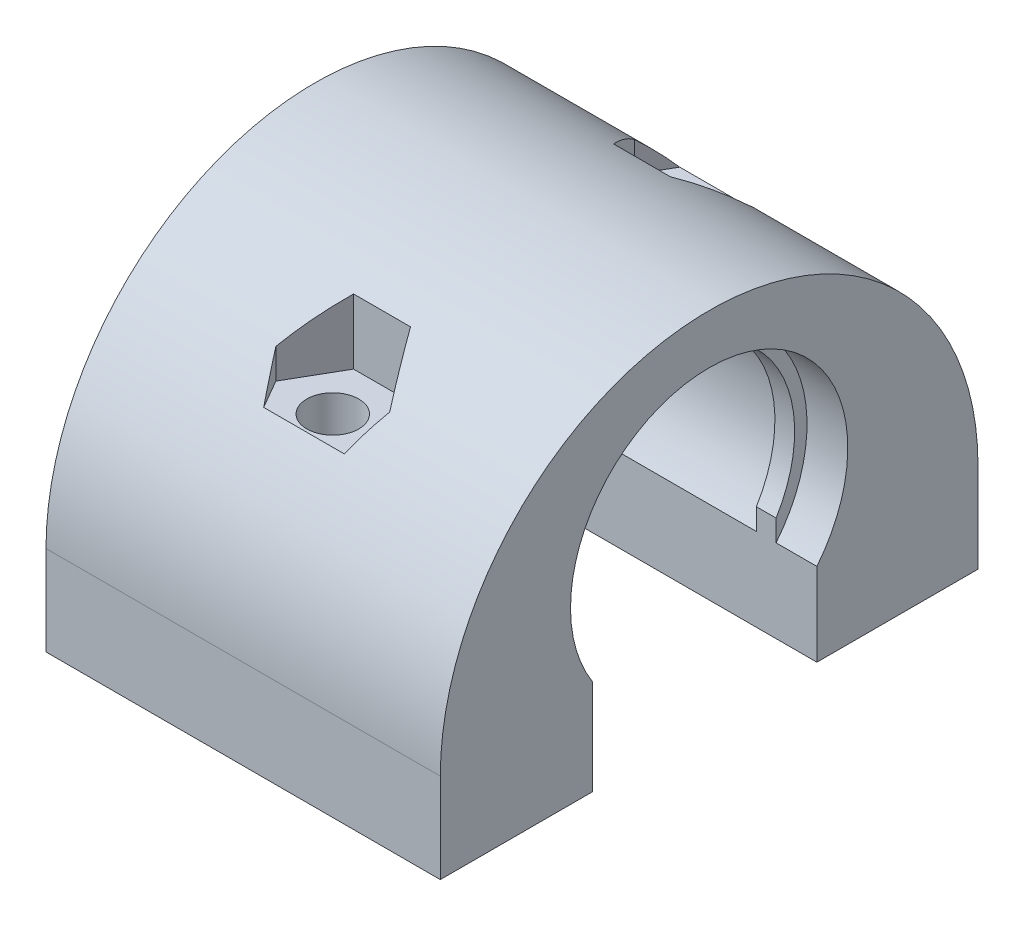
ISO-10303-21;
HEADER;
FILE_DESCRIPTION(('STEP AP214'),'2;1');
FILE_NAME('part.step','',(''),(''),'','','');
FILE_SCHEMA(('AUTOMOTIVE_DESIGN { 1 0 10303 214 1 1 1 1 }'));
ENDSEC;
DATA;
#1=APPLICATION_CONTEXT('core data for automotive mechanical design processes');
#2=APPLICATION_PROTOCOL_DEFINITION('international standard','automotive_design',2000,#1);
#3=PRODUCT_CONTEXT('',#1,'mechanical');
#4=PRODUCT('Part','Part','',(#3));
#5=PRODUCT_RELATED_PRODUCT_CATEGORY('part','',(#4));
#6=PRODUCT_DEFINITION_FORMATION('','',#4);
#7=PRODUCT_DEFINITION_CONTEXT('part definition',#1,'design');
#8=PRODUCT_DEFINITION('design','',#6,#7);
#9=PRODUCT_DEFINITION_SHAPE('','',#8);
#10=(LENGTH_UNIT() NAMED_UNIT(*) SI_UNIT(.MILLI.,.METRE.));
#11=(NAMED_UNIT(*) PLANE_ANGLE_UNIT() SI_UNIT($,.RADIAN.));
#12=(NAMED_UNIT(*) SI_UNIT($,.STERADIAN.) SOLID_ANGLE_UNIT());
#13=UNCERTAINTY_MEASURE_WITH_UNIT(LENGTH_MEASURE(1.E-05),#10,'distance_accuracy_value','');
#14=(GEOMETRIC_REPRESENTATION_CONTEXT(3) GLOBAL_UNCERTAINTY_ASSIGNED_CONTEXT((#13)) GLOBAL_UNIT_ASSIGNED_CONTEXT((#10,
#11,#12)) REPRESENTATION_CONTEXT('',''));
#15=CARTESIAN_POINT('',(0.,0.,0.));
#16=DIRECTION('',(0.,0.,1.));
#17=DIRECTION('',(1.,0.,0.));
#18=AXIS2_PLACEMENT_3D('',#15,#16,#17);
#19=CARTESIAN_POINT('',(3.00000000000002,9.5,0.));
#20=DIRECTION('',(-1.,0.,0.));
#21=DIRECTION('',(0.,0.,1.));
#22=AXIS2_PLACEMENT_3D('',#19,#20,#21);
#23=CYLINDRICAL_SURFACE('',#22,7.735);
#24=CARTESIAN_POINT('',(0.,9.5,0.));
#25=DIRECTION('',(-1.,0.,0.));
#26=DIRECTION('',(0.,0.,1.));
#27=AXIS2_PLACEMENT_3D('',#24,#25,#26);
#28=CIRCLE('',#27,7.735);
#29=CARTESIAN_POINT('',(0.,5.33016037673729,6.51480333673));
#30=VERTEX_POINT('',#29);
#31=CARTESIAN_POINT('',(0.,4.63069563489814,-6.01));
#32=VERTEX_POINT('',#31);
#33=EDGE_CURVE('E269',#30,#32,#28,.T.);
#34=ORIENTED_EDGE('',*,*,#33,.F.);
#35=DIRECTION('',(-1.,0.,0.));
#36=VECTOR('',#35,1.);
#37=CARTESIAN_POINT('',(3.00000000000002,5.33016037673729,6.51480333673));
#38=LINE('',#37,#36);
#39=CARTESIAN_POINT('',(-22.,5.33016037673729,6.51480333673));
#40=VERTEX_POINT('',#39);
#41=EDGE_CURVE('E50',#30,#40,#38,.T.);
#42=ORIENTED_EDGE('',*,*,#41,.T.);
#43=CARTESIAN_POINT('',(-22.,9.5,0.));
#44=DIRECTION('',(-1.,0.,0.));
#45=DIRECTION('',(0.,0.,1.));
#46=AXIS2_PLACEMENT_3D('',#43,#44,#45);
#47=CIRCLE('',#46,7.735);
#48=CARTESIAN_POINT('',(-22.,4.63069563489814,-6.01));
#49=VERTEX_POINT('',#48);
#50=EDGE_CURVE('E271',#40,#49,#47,.T.);
#51=ORIENTED_EDGE('',*,*,#50,.T.);
#52=DIRECTION('',(-1.,0.,0.));
#53=VECTOR('',#52,1.);
#54=CARTESIAN_POINT('',(3.00000000000002,4.63069563489814,-6.01));
#55=LINE('',#54,#53);
#56=CARTESIAN_POINT('',(-19.725,4.63069563489814,-6.01));
#57=VERTEX_POINT('',#56);
#58=EDGE_CURVE('E272',#49,#57,#55,.F.);
#59=ORIENTED_EDGE('',*,*,#58,.T.);
#60=CARTESIAN_POINT('',(-19.725,9.5,0.));
#61=DIRECTION('',(1.,0.,0.));
#62=DIRECTION('',(0.,0.,-1.));
#63=AXIS2_PLACEMENT_3D('',#60,#61,#62);
#64=CIRCLE('',#63,7.735);
#65=CARTESIAN_POINT('',(-19.725,17.2349983839688,-0.00500000000201291));
#66=VERTEX_POINT('',#65);
#67=EDGE_CURVE('E343',#66,#57,#64,.F.);
#68=ORIENTED_EDGE('',*,*,#67,.F.);
#69=DIRECTION('',(-1.,0.,0.));
#70=VECTOR('',#69,1.);
#71=CARTESIAN_POINT('',(-19.175,17.2349983839688,-0.00500000000201291));
#72=LINE('',#71,#70);
#73=CARTESIAN_POINT('',(-18.625,17.2349983839688,-0.00500000000201291));
#74=VERTEX_POINT('',#73);
#75=EDGE_CURVE('E335',#74,#66,#72,.T.);
#76=ORIENTED_EDGE('',*,*,#75,.F.);
#77=CARTESIAN_POINT('',(-18.625,9.5,0.));
#78=DIRECTION('',(-1.,0.,0.));
#79=DIRECTION('',(0.,0.,1.));
#80=AXIS2_PLACEMENT_3D('',#77,#78,#79);
#81=CIRCLE('',#80,7.735);
#82=CARTESIAN_POINT('',(-18.625,4.63069563489814,-6.01));
#83=VERTEX_POINT('',#82);
#84=EDGE_CURVE('E345',#83,#74,#81,.F.);
#85=ORIENTED_EDGE('',*,*,#84,.F.);
#86=CARTESIAN_POINT('',(-3.375,4.63069563489814,-6.01));
#87=VERTEX_POINT('',#86);
#88=EDGE_CURVE('E276',#83,#87,#55,.F.);
#89=ORIENTED_EDGE('',*,*,#88,.T.);
#90=CARTESIAN_POINT('',(-3.375,9.5,0.));
#91=DIRECTION('',(1.,0.,0.));
#92=DIRECTION('',(0.,0.,-1.));
#93=AXIS2_PLACEMENT_3D('',#90,#91,#92);
#94=CIRCLE('',#93,7.735);
#95=CARTESIAN_POINT('',(-3.375,17.2349983839688,-0.00500000000201291));
#96=VERTEX_POINT('',#95);
#97=EDGE_CURVE('E364',#96,#87,#94,.F.);
#98=ORIENTED_EDGE('',*,*,#97,.F.);
#99=DIRECTION('',(-1.,0.,0.));
#100=VECTOR('',#99,1.);
#101=CARTESIAN_POINT('',(-2.825,17.2349983839688,-0.00500000000201291));
#102=LINE('',#101,#100);
#103=CARTESIAN_POINT('',(-2.275,17.2349983839688,-0.00500000000201291));
#104=VERTEX_POINT('',#103);
#105=EDGE_CURVE('E358',#104,#96,#102,.T.);
#106=ORIENTED_EDGE('',*,*,#105,.F.);
#107=CARTESIAN_POINT('',(-2.275,9.5,0.));
#108=DIRECTION('',(-1.,0.,0.));
#109=DIRECTION('',(0.,0.,1.));
#110=AXIS2_PLACEMENT_3D('',#107,#108,#109);
#111=CIRCLE('',#110,7.735);
#112=CARTESIAN_POINT('',(-2.275,4.63069563489814,-6.01));
#113=VERTEX_POINT('',#112);
#114=EDGE_CURVE('E361',#113,#104,#111,.F.);
#115=ORIENTED_EDGE('',*,*,#114,.F.);
#116=EDGE_CURVE('E268',#113,#32,#55,.F.);
#117=ORIENTED_EDGE('',*,*,#116,.T.);
#118=EDGE_LOOP('',(#34,#42,#51,#59,#68,#76,#85,#89,#98,#106,#115,#117));
#119=FACE_BOUND('',#118,.T.);
#120=ADVANCED_FACE('F34',(#119),#23,.F.);
#121=CARTESIAN_POINT('',(-22.,4.99999999999999,-6.01));
#122=DIRECTION('',(0.,0.,-1.));
#123=DIRECTION('',(-1.,0.,0.));
#124=AXIS2_PLACEMENT_3D('',#121,#122,#123);
#125=PLANE('',#124);
#126=ORIENTED_EDGE('',*,*,#116,.F.);
#127=DIRECTION('',(0.,-1.,0.));
#128=VECTOR('',#127,1.);
#129=CARTESIAN_POINT('',(-2.275,17.235,-6.01));
#130=LINE('',#129,#128);
#131=CARTESIAN_POINT('',(-2.275,5.82695970618343,-6.01));
#132=VERTEX_POINT('',#131);
#133=EDGE_CURVE('E481',#132,#113,#130,.T.);
#134=ORIENTED_EDGE('',*,*,#133,.F.);
#135=DIRECTION('',(-1.,0.,0.));
#136=VECTOR('',#135,1.);
#137=CARTESIAN_POINT('',(-21.5348154568122,5.82695970618343,-6.01));
#138=LINE('',#137,#136);
#139=CARTESIAN_POINT('',(-3.375,5.82695970618343,-6.01));
#140=VERTEX_POINT('',#139);
#141=EDGE_CURVE('E484',#140,#132,#138,.F.);
#142=ORIENTED_EDGE('',*,*,#141,.F.);
#143=DIRECTION('',(0.,1.,0.));
#144=VECTOR('',#143,1.);
#145=CARTESIAN_POINT('',(-3.375,17.235,-6.01));
#146=LINE('',#145,#144);
#147=EDGE_CURVE('E471',#87,#140,#146,.T.);
#148=ORIENTED_EDGE('',*,*,#147,.F.);
#149=ORIENTED_EDGE('',*,*,#88,.F.);
#150=DIRECTION('',(0.,-1.,0.));
#151=VECTOR('',#150,1.);
#152=CARTESIAN_POINT('',(-18.625,17.235,-6.01));
#153=LINE('',#152,#151);
#154=CARTESIAN_POINT('',(-18.625,5.82695970618343,-6.01));
#155=VERTEX_POINT('',#154);
#156=EDGE_CURVE('E489',#155,#83,#153,.T.);
#157=ORIENTED_EDGE('',*,*,#156,.F.);
#158=DIRECTION('',(-1.,0.,0.));
#159=VECTOR('',#158,1.);
#160=CARTESIAN_POINT('',(-21.5348154568122,5.82695970618344,-6.01));
#161=LINE('',#160,#159);
#162=CARTESIAN_POINT('',(-19.725,5.82695970618344,-6.01));
#163=VERTEX_POINT('',#162);
#164=EDGE_CURVE('E11',#163,#155,#161,.F.);
#165=ORIENTED_EDGE('',*,*,#164,.F.);
#166=DIRECTION('',(0.,1.,0.));
#167=VECTOR('',#166,1.);
#168=CARTESIAN_POINT('',(-19.725,17.235,-6.01));
#169=LINE('',#168,#167);
#170=EDGE_CURVE('E332',#57,#163,#169,.T.);
#171=ORIENTED_EDGE('',*,*,#170,.F.);
#172=ORIENTED_EDGE('',*,*,#58,.F.);
#173=DIRECTION('',(0.,-1.,0.));
#174=VECTOR('',#173,1.);
#175=CARTESIAN_POINT('',(-22.,4.99999999999999,-6.01));
#176=LINE('',#175,#174);
#177=CARTESIAN_POINT('',(-22.,0.,-6.01));
#178=VERTEX_POINT('',#177);
#179=EDGE_CURVE('E419',#49,#178,#176,.T.);
#180=ORIENTED_EDGE('',*,*,#179,.T.);
#181=DIRECTION('',(1.,0.,0.));
#182=VECTOR('',#181,1.);
#183=CARTESIAN_POINT('',(-22.,0.,-6.01));
#184=LINE('',#183,#182);
#185=CARTESIAN_POINT('',(0.,0.,-6.01));
#186=VERTEX_POINT('',#185);
#187=EDGE_CURVE('E417',#178,#186,#184,.T.);
#188=ORIENTED_EDGE('',*,*,#187,.T.);
#189=DIRECTION('',(0.,-1.,0.));
#190=VECTOR('',#189,1.);
#191=CARTESIAN_POINT('',(0.,4.99999999999999,-6.01));
#192=LINE('',#191,#190);
#193=EDGE_CURVE('E420',#32,#186,#192,.T.);
#194=ORIENTED_EDGE('',*,*,#193,.F.);
#195=EDGE_LOOP('',(#126,#134,#142,#148,#149,#157,#165,#171,#172,#180,#188,#194));
#196=FACE_BOUND('',#195,.T.);
#197=ADVANCED_FACE('F456',(#196),#125,.F.);
#198=CARTESIAN_POINT('',(-22.,5.,0.));
#199=DIRECTION('',(-1.,0.,0.));
#200=DIRECTION('',(0.,0.,1.));
#201=AXIS2_PLACEMENT_3D('',#198,#199,#200);
#202=CYLINDRICAL_SURFACE('',#201,15.);
#203=CARTESIAN_POINT('',(-2.05149730810374,5.,0.));
#204=DIRECTION('',(-0.866025403784439,0.,0.5));
#205=DIRECTION('',(-0.5,0.,-0.866025403784439));
#206=AXIS2_PLACEMENT_3D('',#203,#204,#205);
#207=ELLIPSE('',#206,17.3205080756888,15.);
#208=CARTESIAN_POINT('',(-8.75348706239811,14.5,-11.6081867662439));
#209=VERTEX_POINT('',#208);
#210=CARTESIAN_POINT('',(-7.825,16.1803398874989,-10.));
#211=VERTEX_POINT('',#210);
#212=EDGE_CURVE('E275',#209,#211,#207,.F.);
#213=ORIENTED_EDGE('',*,*,#212,.T.);
#214=CARTESIAN_POINT('',(-13.5985026918963,5.,0.));
#215=DIRECTION('',(-0.866025403784439,0.,-0.5));
#216=DIRECTION('',(-0.5,0.,0.866025403784439));
#217=AXIS2_PLACEMENT_3D('',#214,#215,#216);
#218=ELLIPSE('',#217,17.3205080756888,15.);
#219=CARTESIAN_POINT('',(-9.4125,18.1313420635635,-7.25036934298441));
#220=VERTEX_POINT('',#219);
#221=EDGE_CURVE('E297',#211,#220,#218,.F.);
#222=ORIENTED_EDGE('',*,*,#221,.T.);
#223=DIRECTION('',(-1.,0.,0.));
#224=VECTOR('',#223,1.);
#225=CARTESIAN_POINT('',(-22.,18.1313420635635,-7.25036934298441));
#226=LINE('',#225,#224);
#227=CARTESIAN_POINT('',(-12.5875,18.1313420635635,-7.25036934298441));
#228=VERTEX_POINT('',#227);
#229=EDGE_CURVE('E294',#220,#228,#226,.T.);
#230=ORIENTED_EDGE('',*,*,#229,.T.);
#231=CARTESIAN_POINT('',(-8.40149730810373,5.,0.));
#232=DIRECTION('',(0.866025403784438,0.,-0.5));
#233=DIRECTION('',(-0.5,0.,-0.866025403784438));
#234=AXIS2_PLACEMENT_3D('',#231,#232,#233);
#235=ELLIPSE('',#234,17.3205080756888,15.);
#236=CARTESIAN_POINT('',(-14.175,16.1803398874989,-10.));
#237=VERTEX_POINT('',#236);
#238=EDGE_CURVE('E291',#228,#237,#235,.F.);
#239=ORIENTED_EDGE('',*,*,#238,.T.);
#240=CARTESIAN_POINT('',(-19.9485026918963,5.,0.));
#241=DIRECTION('',(0.866025403784438,0.,0.500000000000001));
#242=DIRECTION('',(-0.500000000000001,0.,0.866025403784438));
#243=AXIS2_PLACEMENT_3D('',#240,#241,#242);
#244=ELLIPSE('',#243,17.3205080756888,15.);
#245=CARTESIAN_POINT('',(-13.2465129376019,14.5,-11.6081867662439));
#246=VERTEX_POINT('',#245);
#247=EDGE_CURVE('E288',#237,#246,#244,.F.);
#248=ORIENTED_EDGE('',*,*,#247,.T.);
#249=DIRECTION('',(-1.,0.,0.));
#250=VECTOR('',#249,1.);
#251=CARTESIAN_POINT('',(-22.,14.5,-11.6081867662439));
#252=LINE('',#251,#250);
#253=EDGE_CURVE('E280',#246,#209,#252,.F.);
#254=ORIENTED_EDGE('',*,*,#253,.T.);
#255=EDGE_LOOP('',(#213,#222,#230,#239,#248,#254));
#256=FACE_BOUND('',#255,.T.);
#257=DIRECTION('',(1.,0.,0.));
#258=VECTOR('',#257,1.);
#259=CARTESIAN_POINT('',(-22.,5.,-15.));
#260=LINE('',#259,#258);
#261=CARTESIAN_POINT('',(-22.,5.,-15.));
#262=VERTEX_POINT('',#261);
#263=CARTESIAN_POINT('',(0.,5.,-15.));
#264=VERTEX_POINT('',#263);
#265=EDGE_CURVE('E258',#262,#264,#260,.T.);
#266=ORIENTED_EDGE('',*,*,#265,.F.);
#267=CARTESIAN_POINT('',(-22.,5.,0.));
#268=DIRECTION('',(1.,0.,0.));
#269=DIRECTION('',(0.,0.,-1.));
#270=AXIS2_PLACEMENT_3D('',#267,#268,#269);
#271=CIRCLE('',#270,15.);
#272=CARTESIAN_POINT('',(-22.,5.,15.));
#273=VERTEX_POINT('',#272);
#274=EDGE_CURVE('E264',#273,#262,#271,.F.);
#275=ORIENTED_EDGE('',*,*,#274,.F.);
#276=DIRECTION('',(1.,0.,0.));
#277=VECTOR('',#276,1.);
#278=CARTESIAN_POINT('',(-22.,5.,15.));
#279=LINE('',#278,#277);
#280=CARTESIAN_POINT('',(0.,5.,15.));
#281=VERTEX_POINT('',#280);
#282=EDGE_CURVE('E261',#281,#273,#279,.F.);
#283=ORIENTED_EDGE('',*,*,#282,.F.);
#284=CARTESIAN_POINT('',(0.,5.,0.));
#285=DIRECTION('',(-1.,0.,0.));
#286=DIRECTION('',(0.,0.,1.));
#287=AXIS2_PLACEMENT_3D('',#284,#285,#286);
#288=CIRCLE('',#287,15.);
#289=EDGE_CURVE('E266',#264,#281,#288,.F.);
#290=ORIENTED_EDGE('',*,*,#289,.F.);
#291=EDGE_LOOP('',(#266,#275,#283,#290));
#292=FACE_BOUND('',#291,.T.);
#293=DIRECTION('',(-1.,0.,0.));
#294=VECTOR('',#293,1.);
#295=CARTESIAN_POINT('',(-22.,14.5,11.6081867662439));
#296=LINE('',#295,#294);
#297=CARTESIAN_POINT('',(-8.75348706239811,14.5,11.6081867662439));
#298=VERTEX_POINT('',#297);
#299=CARTESIAN_POINT('',(-13.2465129376019,14.5,11.6081867662439));
#300=VERTEX_POINT('',#299);
#301=EDGE_CURVE('E285',#298,#300,#296,.T.);
#302=ORIENTED_EDGE('',*,*,#301,.T.);
#303=CARTESIAN_POINT('',(-19.9485026918963,5.,0.));
#304=DIRECTION('',(0.866025403784439,0.,-0.5));
#305=DIRECTION('',(-0.5,0.,-0.866025403784439));
#306=AXIS2_PLACEMENT_3D('',#303,#304,#305);
#307=ELLIPSE('',#306,17.3205080756888,15.);
#308=CARTESIAN_POINT('',(-14.175,16.180339887499,10.));
#309=VERTEX_POINT('',#308);
#310=EDGE_CURVE('E312',#300,#309,#307,.F.);
#311=ORIENTED_EDGE('',*,*,#310,.T.);
#312=CARTESIAN_POINT('',(-8.40149730810373,5.,0.));
#313=DIRECTION('',(0.866025403784439,0.,0.5));
#314=DIRECTION('',(-0.5,0.,0.866025403784439));
#315=AXIS2_PLACEMENT_3D('',#312,#313,#314);
#316=ELLIPSE('',#315,17.3205080756888,15.);
#317=CARTESIAN_POINT('',(-12.5875,18.1313420635635,7.25036934298441));
#318=VERTEX_POINT('',#317);
#319=EDGE_CURVE('E309',#309,#318,#316,.F.);
#320=ORIENTED_EDGE('',*,*,#319,.T.);
#321=DIRECTION('',(-1.,0.,0.));
#322=VECTOR('',#321,1.);
#323=CARTESIAN_POINT('',(-22.,18.1313420635635,7.25036934298441));
#324=LINE('',#323,#322);
#325=CARTESIAN_POINT('',(-9.41249999999999,18.1313420635635,7.25036934298441));
#326=VERTEX_POINT('',#325);
#327=EDGE_CURVE('E306',#318,#326,#324,.F.);
#328=ORIENTED_EDGE('',*,*,#327,.T.);
#329=CARTESIAN_POINT('',(-13.5985026918962,5.,0.));
#330=DIRECTION('',(-0.866025403784439,0.,0.499999999999999));
#331=DIRECTION('',(-0.499999999999999,0.,-0.866025403784439));
#332=AXIS2_PLACEMENT_3D('',#329,#330,#331);
#333=ELLIPSE('',#332,17.3205080756888,15.);
#334=CARTESIAN_POINT('',(-7.82499999999999,16.180339887499,10.));
#335=VERTEX_POINT('',#334);
#336=EDGE_CURVE('E303',#326,#335,#333,.F.);
#337=ORIENTED_EDGE('',*,*,#336,.T.);
#338=CARTESIAN_POINT('',(-2.05149730810374,5.,0.));
#339=DIRECTION('',(-0.866025403784439,0.,-0.5));
#340=DIRECTION('',(-0.5,0.,0.866025403784439));
#341=AXIS2_PLACEMENT_3D('',#338,#339,#340);
#342=ELLIPSE('',#341,17.3205080756888,15.);
#343=EDGE_CURVE('E300',#335,#298,#342,.F.);
#344=ORIENTED_EDGE('',*,*,#343,.T.);
#345=EDGE_LOOP('',(#302,#311,#320,#328,#337,#344));
#346=FACE_BOUND('',#345,.T.);
#347=ADVANCED_FACE('F37',(#256,#292,#346),#202,.T.);
#348=CARTESIAN_POINT('',(-11.,19.,10.));
#349=DIRECTION('',(0.,-1.,0.));
#350=DIRECTION('',(0.,0.,-1.));
#351=AXIS2_PLACEMENT_3D('',#348,#349,#350);
#352=CYLINDRICAL_SURFACE('',#351,1.45);
#353=CARTESIAN_POINT('',(-11.,0.,10.));
#354=DIRECTION('',(0.,-1.,0.));
#355=DIRECTION('',(0.,0.,-1.));
#356=AXIS2_PLACEMENT_3D('',#353,#354,#355);
#357=CIRCLE('',#356,1.45);
#358=CARTESIAN_POINT('',(-11.,0.,8.55));
#359=VERTEX_POINT('',#358);
#360=EDGE_CURVE('E423',#359,#359,#357,.T.);
#361=ORIENTED_EDGE('',*,*,#360,.T.);
#362=EDGE_LOOP('',(#361));
#363=FACE_BOUND('',#362,.T.);
#364=CARTESIAN_POINT('',(-11.,14.5,10.));
#365=DIRECTION('',(0.,1.,0.));
#366=DIRECTION('',(0.,0.,1.));
#367=AXIS2_PLACEMENT_3D('',#364,#365,#366);
#368=CIRCLE('',#367,1.45);
#369=CARTESIAN_POINT('',(-11.,14.5,11.45));
#370=VERTEX_POINT('',#369);
#371=EDGE_CURVE('E282',#370,#370,#368,.F.);
#372=ORIENTED_EDGE('',*,*,#371,.F.);
#373=EDGE_LOOP('',(#372));
#374=FACE_BOUND('',#373,.T.);
#375=ADVANCED_FACE('F528',(#363,#374),#352,.F.);
#376=CARTESIAN_POINT('',(-11.,19.,-10.));
#377=DIRECTION('',(0.,-1.,0.));
#378=DIRECTION('',(0.,0.,-1.));
#379=AXIS2_PLACEMENT_3D('',#376,#377,#378);
#380=CYLINDRICAL_SURFACE('',#379,1.45);
#381=CARTESIAN_POINT('',(-11.,0.,-10.));
#382=DIRECTION('',(0.,-1.,0.));
#383=DIRECTION('',(0.,0.,-1.));
#384=AXIS2_PLACEMENT_3D('',#381,#382,#383);
#385=CIRCLE('',#384,1.45);
#386=CARTESIAN_POINT('',(-11.,0.,-11.45));
#387=VERTEX_POINT('',#386);
#388=EDGE_CURVE('E425',#387,#387,#385,.T.);
#389=ORIENTED_EDGE('',*,*,#388,.T.);
#390=EDGE_LOOP('',(#389));
#391=FACE_BOUND('',#390,.T.);
#392=CARTESIAN_POINT('',(-11.,14.5,-10.));
#393=DIRECTION('',(0.,1.,0.));
#394=DIRECTION('',(0.,0.,1.));
#395=AXIS2_PLACEMENT_3D('',#392,#393,#394);
#396=CIRCLE('',#395,1.45);
#397=CARTESIAN_POINT('',(-11.,14.5,-8.55));
#398=VERTEX_POINT('',#397);
#399=EDGE_CURVE('E277',#398,#398,#396,.F.);
#400=ORIENTED_EDGE('',*,*,#399,.F.);
#401=EDGE_LOOP('',(#400));
#402=FACE_BOUND('',#401,.T.);
#403=ADVANCED_FACE('F543',(#391,#402),#380,.F.);
#404=CARTESIAN_POINT('',(0.,0.,0.));
#405=DIRECTION('',(0.,1.,0.));
#406=DIRECTION('',(0.,0.,1.));
#407=AXIS2_PLACEMENT_3D('',#404,#405,#406);
#408=PLANE('',#407);
#409=ORIENTED_EDGE('',*,*,#360,.F.);
#410=EDGE_LOOP('',(#409));
#411=FACE_BOUND('',#410,.T.);
#412=DIRECTION('',(0.,0.,1.));
#413=VECTOR('',#412,1.);
#414=CARTESIAN_POINT('',(-22.,0.,-15.));
#415=LINE('',#414,#413);
#416=CARTESIAN_POINT('',(-22.,0.,6.51480333673));
#417=VERTEX_POINT('',#416);
#418=CARTESIAN_POINT('',(-22.,0.,15.));
#419=VERTEX_POINT('',#418);
#420=EDGE_CURVE('E233',#417,#419,#415,.T.);
#421=ORIENTED_EDGE('',*,*,#420,.F.);
#422=DIRECTION('',(-1.,0.,0.));
#423=VECTOR('',#422,1.);
#424=CARTESIAN_POINT('',(0.,0.,6.51480333673));
#425=LINE('',#424,#423);
#426=CARTESIAN_POINT('',(0.,0.,6.51480333673));
#427=VERTEX_POINT('',#426);
#428=EDGE_CURVE('E220',#427,#417,#425,.T.);
#429=ORIENTED_EDGE('',*,*,#428,.F.);
#430=DIRECTION('',(0.,0.,-1.));
#431=VECTOR('',#430,1.);
#432=CARTESIAN_POINT('',(0.,0.,-15.));
#433=LINE('',#432,#431);
#434=CARTESIAN_POINT('',(0.,0.,15.));
#435=VERTEX_POINT('',#434);
#436=EDGE_CURVE('E232',#435,#427,#433,.T.);
#437=ORIENTED_EDGE('',*,*,#436,.F.);
#438=DIRECTION('',(1.,0.,0.));
#439=VECTOR('',#438,1.);
#440=CARTESIAN_POINT('',(-22.,0.,15.));
#441=LINE('',#440,#439);
#442=EDGE_CURVE('E246',#419,#435,#441,.T.);
#443=ORIENTED_EDGE('',*,*,#442,.F.);
#444=EDGE_LOOP('',(#421,#429,#437,#443));
#445=FACE_BOUND('',#444,.T.);
#446=ADVANCED_FACE('F230',(#411,#445),#408,.F.);
#447=CARTESIAN_POINT('',(-22.,20.,-15.));
#448=DIRECTION('',(1.,0.,0.));
#449=DIRECTION('',(0.,0.,-1.));
#450=AXIS2_PLACEMENT_3D('',#447,#448,#449);
#451=PLANE('',#450);
#452=ORIENTED_EDGE('',*,*,#50,.F.);
#453=DIRECTION('',(0.,1.,0.));
#454=VECTOR('',#453,1.);
#455=CARTESIAN_POINT('',(-22.,0.,6.51480333673));
#456=LINE('',#455,#454);
#457=EDGE_CURVE('E225',#417,#40,#456,.T.);
#458=ORIENTED_EDGE('',*,*,#457,.F.);
#459=ORIENTED_EDGE('',*,*,#420,.T.);
#460=DIRECTION('',(0.,-1.,0.));
#461=VECTOR('',#460,1.);
#462=CARTESIAN_POINT('',(-22.,20.,15.));
#463=LINE('',#462,#461);
#464=EDGE_CURVE('E255',#273,#419,#463,.T.);
#465=ORIENTED_EDGE('',*,*,#464,.F.);
#466=ORIENTED_EDGE('',*,*,#274,.T.);
#467=DIRECTION('',(0.,-1.,0.));
#468=VECTOR('',#467,1.);
#469=CARTESIAN_POINT('',(-22.,20.,-15.));
#470=LINE('',#469,#468);
#471=CARTESIAN_POINT('',(-22.,0.,-15.));
#472=VERTEX_POINT('',#471);
#473=EDGE_CURVE('E244',#262,#472,#470,.T.);
#474=ORIENTED_EDGE('',*,*,#473,.T.);
#475=EDGE_CURVE('E430',#472,#178,#415,.T.);
#476=ORIENTED_EDGE('',*,*,#475,.T.);
#477=ORIENTED_EDGE('',*,*,#179,.F.);
#478=EDGE_LOOP('',(#452,#458,#459,#465,#466,#474,#476,#477));
#479=FACE_BOUND('',#478,.T.);
#480=ADVANCED_FACE('F437',(#479),#451,.F.);
#481=CARTESIAN_POINT('',(-22.,20.,15.));
#482=DIRECTION('',(0.,0.,-1.));
#483=DIRECTION('',(-1.,0.,0.));
#484=AXIS2_PLACEMENT_3D('',#481,#482,#483);
#485=PLANE('',#484);
#486=ORIENTED_EDGE('',*,*,#464,.T.);
#487=ORIENTED_EDGE('',*,*,#442,.T.);
#488=DIRECTION('',(0.,-1.,0.));
#489=VECTOR('',#488,1.);
#490=CARTESIAN_POINT('',(0.,20.,15.));
#491=LINE('',#490,#489);
#492=EDGE_CURVE('E238',#281,#435,#491,.T.);
#493=ORIENTED_EDGE('',*,*,#492,.F.);
#494=ORIENTED_EDGE('',*,*,#282,.T.);
#495=EDGE_LOOP('',(#486,#487,#493,#494));
#496=FACE_BOUND('',#495,.T.);
#497=ADVANCED_FACE('F439',(#496),#485,.F.);
#498=CARTESIAN_POINT('',(0.,20.,-15.));
#499=DIRECTION('',(-1.,0.,0.));
#500=DIRECTION('',(0.,0.,1.));
#501=AXIS2_PLACEMENT_3D('',#498,#499,#500);
#502=PLANE('',#501);
#503=ORIENTED_EDGE('',*,*,#436,.T.);
#504=DIRECTION('',(0.,1.,0.));
#505=VECTOR('',#504,1.);
#506=CARTESIAN_POINT('',(0.,0.,6.51480333673));
#507=LINE('',#506,#505);
#508=EDGE_CURVE('E217',#427,#30,#507,.T.);
#509=ORIENTED_EDGE('',*,*,#508,.T.);
#510=ORIENTED_EDGE('',*,*,#33,.T.);
#511=ORIENTED_EDGE('',*,*,#193,.T.);
#512=CARTESIAN_POINT('',(0.,0.,-15.));
#513=VERTEX_POINT('',#512);
#514=EDGE_CURVE('E241',#186,#513,#433,.T.);
#515=ORIENTED_EDGE('',*,*,#514,.T.);
#516=DIRECTION('',(0.,-1.,0.));
#517=VECTOR('',#516,1.);
#518=CARTESIAN_POINT('',(0.,20.,-15.));
#519=LINE('',#518,#517);
#520=EDGE_CURVE('E251',#264,#513,#519,.T.);
#521=ORIENTED_EDGE('',*,*,#520,.F.);
#522=ORIENTED_EDGE('',*,*,#289,.T.);
#523=ORIENTED_EDGE('',*,*,#492,.T.);
#524=EDGE_LOOP('',(#503,#509,#510,#511,#515,#521,#522,#523));
#525=FACE_BOUND('',#524,.T.);
#526=ADVANCED_FACE('F236',(#525),#502,.F.);
#527=CARTESIAN_POINT('',(-22.,20.,-15.));
#528=DIRECTION('',(0.,0.,1.));
#529=DIRECTION('',(1.,0.,0.));
#530=AXIS2_PLACEMENT_3D('',#527,#528,#529);
#531=PLANE('',#530);
#532=ORIENTED_EDGE('',*,*,#473,.F.);
#533=ORIENTED_EDGE('',*,*,#265,.T.);
#534=ORIENTED_EDGE('',*,*,#520,.T.);
#535=DIRECTION('',(-1.,0.,0.));
#536=VECTOR('',#535,1.);
#537=CARTESIAN_POINT('',(-22.,0.,-15.));
#538=LINE('',#537,#536);
#539=EDGE_CURVE('E240',#513,#472,#538,.T.);
#540=ORIENTED_EDGE('',*,*,#539,.T.);
#541=EDGE_LOOP('',(#532,#533,#534,#540));
#542=FACE_BOUND('',#541,.T.);
#543=ADVANCED_FACE('F447',(#542),#531,.F.);
#544=ORIENTED_EDGE('',*,*,#388,.F.);
#545=EDGE_LOOP('',(#544));
#546=FACE_BOUND('',#545,.T.);
#547=ORIENTED_EDGE('',*,*,#514,.F.);
#548=ORIENTED_EDGE('',*,*,#187,.F.);
#549=ORIENTED_EDGE('',*,*,#475,.F.);
#550=ORIENTED_EDGE('',*,*,#539,.F.);
#551=EDGE_LOOP('',(#547,#548,#549,#550));
#552=FACE_BOUND('',#551,.T.);
#553=ADVANCED_FACE('F452',(#546,#552),#408,.F.);
#554=CARTESIAN_POINT('',(0.,14.5,0.));
#555=DIRECTION('',(0.,1.,0.));
#556=DIRECTION('',(0.,0.,1.));
#557=AXIS2_PLACEMENT_3D('',#554,#555,#556);
#558=PLANE('',#557);
#559=DIRECTION('',(0.500000000000001,0.,-0.866025403784438));
#560=VECTOR('',#559,1.);
#561=CARTESIAN_POINT('',(-12.5875,14.5,-12.7496306570156));
#562=LINE('',#561,#560);
#563=CARTESIAN_POINT('',(-14.175,14.5,-10.));
#564=VERTEX_POINT('',#563);
#565=EDGE_CURVE('E397',#564,#246,#562,.T.);
#566=ORIENTED_EDGE('',*,*,#565,.F.);
#567=DIRECTION('',(-0.5,0.,-0.866025403784438));
#568=VECTOR('',#567,1.);
#569=CARTESIAN_POINT('',(-14.175,14.5,-10.));
#570=LINE('',#569,#568);
#571=CARTESIAN_POINT('',(-12.5875,14.5,-7.25036934298441));
#572=VERTEX_POINT('',#571);
#573=EDGE_CURVE('E395',#572,#564,#570,.T.);
#574=ORIENTED_EDGE('',*,*,#573,.F.);
#575=DIRECTION('',(-1.,0.,0.));
#576=VECTOR('',#575,1.);
#577=CARTESIAN_POINT('',(-12.5875,14.5,-7.25036934298441));
#578=LINE('',#577,#576);
#579=CARTESIAN_POINT('',(-9.4125,14.5,-7.25036934298441));
#580=VERTEX_POINT('',#579);
#581=EDGE_CURVE('E393',#580,#572,#578,.T.);
#582=ORIENTED_EDGE('',*,*,#581,.F.);
#583=DIRECTION('',(-0.5,0.,0.866025403784439));
#584=VECTOR('',#583,1.);
#585=CARTESIAN_POINT('',(-9.4125,14.5,-7.25036934298441));
#586=LINE('',#585,#584);
#587=CARTESIAN_POINT('',(-7.825,14.5,-10.));
#588=VERTEX_POINT('',#587);
#589=EDGE_CURVE('E367',#588,#580,#586,.T.);
#590=ORIENTED_EDGE('',*,*,#589,.F.);
#591=DIRECTION('',(0.5,0.,0.866025403784439));
#592=VECTOR('',#591,1.);
#593=CARTESIAN_POINT('',(-7.825,14.5,-10.));
#594=LINE('',#593,#592);
#595=EDGE_CURVE('E400',#209,#588,#594,.T.);
#596=ORIENTED_EDGE('',*,*,#595,.F.);
#597=ORIENTED_EDGE('',*,*,#253,.F.);
#598=EDGE_LOOP('',(#566,#574,#582,#590,#596,#597));
#599=FACE_BOUND('',#598,.T.);
#600=ORIENTED_EDGE('',*,*,#399,.T.);
#601=EDGE_LOOP('',(#600));
#602=FACE_BOUND('',#601,.T.);
#603=ADVANCED_FACE('F532',(#599,#602),#558,.T.);
#604=CARTESIAN_POINT('',(-9.4125,14.5,-7.25036934298441));
#605=DIRECTION('',(-0.866025403784439,0.,-0.5));
#606=DIRECTION('',(-0.5,0.,0.866025403784439));
#607=AXIS2_PLACEMENT_3D('',#604,#605,#606);
#608=PLANE('',#607);
#609=DIRECTION('',(0.,1.,0.));
#610=VECTOR('',#609,1.);
#611=CARTESIAN_POINT('',(-7.825,14.5,-10.));
#612=LINE('',#611,#610);
#613=EDGE_CURVE('E402',#588,#211,#612,.T.);
#614=ORIENTED_EDGE('',*,*,#613,.F.);
#615=ORIENTED_EDGE('',*,*,#589,.T.);
#616=DIRECTION('',(0.,1.,0.));
#617=VECTOR('',#616,1.);
#618=CARTESIAN_POINT('',(-9.4125,14.5,-7.25036934298441));
#619=LINE('',#618,#617);
#620=EDGE_CURVE('E371',#580,#220,#619,.T.);
#621=ORIENTED_EDGE('',*,*,#620,.T.);
#622=ORIENTED_EDGE('',*,*,#221,.F.);
#623=EDGE_LOOP('',(#614,#615,#621,#622));
#624=FACE_BOUND('',#623,.T.);
#625=ADVANCED_FACE('F591',(#624),#608,.T.);
#626=CARTESIAN_POINT('',(-12.5875,14.5,-7.25036934298441));
#627=DIRECTION('',(0.,0.,-1.));
#628=DIRECTION('',(-1.,0.,0.));
#629=AXIS2_PLACEMENT_3D('',#626,#627,#628);
#630=PLANE('',#629);
#631=ORIENTED_EDGE('',*,*,#620,.F.);
#632=ORIENTED_EDGE('',*,*,#581,.T.);
#633=DIRECTION('',(0.,1.,0.));
#634=VECTOR('',#633,1.);
#635=CARTESIAN_POINT('',(-12.5875,14.5,-7.25036934298441));
#636=LINE('',#635,#634);
#637=EDGE_CURVE('E408',#572,#228,#636,.T.);
#638=ORIENTED_EDGE('',*,*,#637,.T.);
#639=ORIENTED_EDGE('',*,*,#229,.F.);
#640=EDGE_LOOP('',(#631,#632,#638,#639));
#641=FACE_BOUND('',#640,.T.);
#642=ADVANCED_FACE('F600',(#641),#630,.T.);
#643=CARTESIAN_POINT('',(-14.175,14.5,-10.));
#644=DIRECTION('',(0.866025403784438,0.,-0.5));
#645=DIRECTION('',(-0.5,0.,-0.866025403784438));
#646=AXIS2_PLACEMENT_3D('',#643,#644,#645);
#647=PLANE('',#646);
#648=ORIENTED_EDGE('',*,*,#637,.F.);
#649=ORIENTED_EDGE('',*,*,#573,.T.);
#650=DIRECTION('',(0.,1.,0.));
#651=VECTOR('',#650,1.);
#652=CARTESIAN_POINT('',(-14.175,14.5,-10.));
#653=LINE('',#652,#651);
#654=EDGE_CURVE('E405',#564,#237,#653,.T.);
#655=ORIENTED_EDGE('',*,*,#654,.T.);
#656=ORIENTED_EDGE('',*,*,#238,.F.);
#657=EDGE_LOOP('',(#648,#649,#655,#656));
#658=FACE_BOUND('',#657,.T.);
#659=ADVANCED_FACE('F596',(#658),#647,.T.);
#660=CARTESIAN_POINT('',(-12.5875,14.5,-12.7496306570156));
#661=DIRECTION('',(0.866025403784438,0.,0.500000000000001));
#662=DIRECTION('',(0.500000000000001,0.,-0.866025403784438));
#663=AXIS2_PLACEMENT_3D('',#660,#661,#662);
#664=PLANE('',#663);
#665=ORIENTED_EDGE('',*,*,#654,.F.);
#666=ORIENTED_EDGE('',*,*,#565,.T.);
#667=ORIENTED_EDGE('',*,*,#247,.F.);
#668=EDGE_LOOP('',(#665,#666,#667));
#669=FACE_BOUND('',#668,.T.);
#670=ADVANCED_FACE('F568',(#669),#664,.T.);
#671=CARTESIAN_POINT('',(-7.825,14.5,-10.));
#672=DIRECTION('',(-0.866025403784439,0.,0.5));
#673=DIRECTION('',(0.5,0.,0.866025403784439));
#674=AXIS2_PLACEMENT_3D('',#671,#672,#673);
#675=PLANE('',#674);
#676=ORIENTED_EDGE('',*,*,#595,.T.);
#677=ORIENTED_EDGE('',*,*,#613,.T.);
#678=ORIENTED_EDGE('',*,*,#212,.F.);
#679=EDGE_LOOP('',(#676,#677,#678));
#680=FACE_BOUND('',#679,.T.);
#681=ADVANCED_FACE('F558',(#680),#675,.T.);
#682=CARTESIAN_POINT('',(0.,14.5,0.));
#683=DIRECTION('',(0.,1.,0.));
#684=DIRECTION('',(0.,0.,1.));
#685=AXIS2_PLACEMENT_3D('',#682,#683,#684);
#686=PLANE('',#685);
#687=DIRECTION('',(-0.5,0.,0.866025403784439));
#688=VECTOR('',#687,1.);
#689=CARTESIAN_POINT('',(-9.4125,14.5,12.7496306570156));
#690=LINE('',#689,#688);
#691=CARTESIAN_POINT('',(-7.82499999999999,14.5,10.));
#692=VERTEX_POINT('',#691);
#693=EDGE_CURVE('E377',#692,#298,#690,.T.);
#694=ORIENTED_EDGE('',*,*,#693,.F.);
#695=DIRECTION('',(0.499999999999999,0.,0.866025403784439));
#696=VECTOR('',#695,1.);
#697=CARTESIAN_POINT('',(-7.82499999999999,14.5,10.));
#698=LINE('',#697,#696);
#699=CARTESIAN_POINT('',(-9.41249999999999,14.5,7.25036934298441));
#700=VERTEX_POINT('',#699);
#701=EDGE_CURVE('E375',#700,#692,#698,.T.);
#702=ORIENTED_EDGE('',*,*,#701,.F.);
#703=DIRECTION('',(1.,0.,0.));
#704=VECTOR('',#703,1.);
#705=CARTESIAN_POINT('',(-9.41249999999999,14.5,7.25036934298441));
#706=LINE('',#705,#704);
#707=CARTESIAN_POINT('',(-12.5875,14.5,7.25036934298441));
#708=VERTEX_POINT('',#707);
#709=EDGE_CURVE('E373',#708,#700,#706,.T.);
#710=ORIENTED_EDGE('',*,*,#709,.F.);
#711=DIRECTION('',(0.5,0.,-0.866025403784439));
#712=VECTOR('',#711,1.);
#713=CARTESIAN_POINT('',(-12.5875,14.5,7.25036934298441));
#714=LINE('',#713,#712);
#715=CARTESIAN_POINT('',(-14.175,14.5,10.));
#716=VERTEX_POINT('',#715);
#717=EDGE_CURVE('E370',#716,#708,#714,.T.);
#718=ORIENTED_EDGE('',*,*,#717,.F.);
#719=DIRECTION('',(-0.5,0.,-0.866025403784439));
#720=VECTOR('',#719,1.);
#721=CARTESIAN_POINT('',(-14.175,14.5,10.));
#722=LINE('',#721,#720);
#723=EDGE_CURVE('E368',#300,#716,#722,.T.);
#724=ORIENTED_EDGE('',*,*,#723,.F.);
#725=ORIENTED_EDGE('',*,*,#301,.F.);
#726=EDGE_LOOP('',(#694,#702,#710,#718,#724,#725));
#727=FACE_BOUND('',#726,.T.);
#728=ORIENTED_EDGE('',*,*,#371,.T.);
#729=EDGE_LOOP('',(#728));
#730=FACE_BOUND('',#729,.T.);
#731=ADVANCED_FACE('F555',(#727,#730),#686,.T.);
#732=CARTESIAN_POINT('',(-14.175,14.5,10.));
#733=DIRECTION('',(0.866025403784439,0.,-0.5));
#734=DIRECTION('',(-0.5,0.,-0.866025403784439));
#735=AXIS2_PLACEMENT_3D('',#732,#733,#734);
#736=PLANE('',#735);
#737=ORIENTED_EDGE('',*,*,#723,.T.);
#738=DIRECTION('',(0.,1.,0.));
#739=VECTOR('',#738,1.);
#740=CARTESIAN_POINT('',(-14.175,14.5,10.));
#741=LINE('',#740,#739);
#742=EDGE_CURVE('E281',#716,#309,#741,.T.);
#743=ORIENTED_EDGE('',*,*,#742,.T.);
#744=ORIENTED_EDGE('',*,*,#310,.F.);
#745=EDGE_LOOP('',(#737,#743,#744));
#746=FACE_BOUND('',#745,.T.);
#747=ADVANCED_FACE('F557',(#746),#736,.T.);
#748=CARTESIAN_POINT('',(-12.5875,14.5,7.25036934298441));
#749=DIRECTION('',(0.866025403784439,0.,0.5));
#750=DIRECTION('',(0.5,0.,-0.866025403784439));
#751=AXIS2_PLACEMENT_3D('',#748,#749,#750);
#752=PLANE('',#751);
#753=ORIENTED_EDGE('',*,*,#742,.F.);
#754=ORIENTED_EDGE('',*,*,#717,.T.);
#755=DIRECTION('',(0.,1.,0.));
#756=VECTOR('',#755,1.);
#757=CARTESIAN_POINT('',(-12.5875,14.5,7.25036934298441));
#758=LINE('',#757,#756);
#759=EDGE_CURVE('E386',#708,#318,#758,.T.);
#760=ORIENTED_EDGE('',*,*,#759,.T.);
#761=ORIENTED_EDGE('',*,*,#319,.F.);
#762=EDGE_LOOP('',(#753,#754,#760,#761));
#763=FACE_BOUND('',#762,.T.);
#764=ADVANCED_FACE('F565',(#763),#752,.T.);
#765=CARTESIAN_POINT('',(-9.41249999999999,14.5,7.25036934298441));
#766=DIRECTION('',(0.,0.,1.));
#767=DIRECTION('',(1.,0.,0.));
#768=AXIS2_PLACEMENT_3D('',#765,#766,#767);
#769=PLANE('',#768);
#770=ORIENTED_EDGE('',*,*,#759,.F.);
#771=ORIENTED_EDGE('',*,*,#709,.T.);
#772=DIRECTION('',(0.,1.,0.));
#773=VECTOR('',#772,1.);
#774=CARTESIAN_POINT('',(-9.41249999999999,14.5,7.25036934298441));
#775=LINE('',#774,#773);
#776=EDGE_CURVE('E383',#700,#326,#775,.T.);
#777=ORIENTED_EDGE('',*,*,#776,.T.);
#778=ORIENTED_EDGE('',*,*,#327,.F.);
#779=EDGE_LOOP('',(#770,#771,#777,#778));
#780=FACE_BOUND('',#779,.T.);
#781=ADVANCED_FACE('F582',(#780),#769,.T.);
#782=CARTESIAN_POINT('',(-7.82499999999999,14.5,10.));
#783=DIRECTION('',(-0.866025403784439,0.,0.499999999999999));
#784=DIRECTION('',(0.499999999999999,0.,0.866025403784439));
#785=AXIS2_PLACEMENT_3D('',#782,#783,#784);
#786=PLANE('',#785);
#787=ORIENTED_EDGE('',*,*,#776,.F.);
#788=ORIENTED_EDGE('',*,*,#701,.T.);
#789=DIRECTION('',(0.,1.,0.));
#790=VECTOR('',#789,1.);
#791=CARTESIAN_POINT('',(-7.82499999999999,14.5,10.));
#792=LINE('',#791,#790);
#793=EDGE_CURVE('E380',#692,#335,#792,.T.);
#794=ORIENTED_EDGE('',*,*,#793,.T.);
#795=ORIENTED_EDGE('',*,*,#336,.F.);
#796=EDGE_LOOP('',(#787,#788,#794,#795));
#797=FACE_BOUND('',#796,.T.);
#798=ADVANCED_FACE('F578',(#797),#786,.T.);
#799=CARTESIAN_POINT('',(-9.4125,14.5,12.7496306570156));
#800=DIRECTION('',(-0.866025403784439,0.,-0.5));
#801=DIRECTION('',(-0.5,0.,0.866025403784439));
#802=AXIS2_PLACEMENT_3D('',#799,#800,#801);
#803=PLANE('',#802);
#804=ORIENTED_EDGE('',*,*,#793,.F.);
#805=ORIENTED_EDGE('',*,*,#693,.T.);
#806=ORIENTED_EDGE('',*,*,#343,.F.);
#807=EDGE_LOOP('',(#804,#805,#806));
#808=FACE_BOUND('',#807,.T.);
#809=ADVANCED_FACE('F575',(#808),#803,.T.);
#810=CARTESIAN_POINT('',(-3.375,17.235,-0.00999999999999959));
#811=DIRECTION('',(1.,0.,0.));
#812=DIRECTION('',(0.,0.,-1.));
#813=AXIS2_PLACEMENT_3D('',#810,#811,#812);
#814=PLANE('',#813);
#815=ORIENTED_EDGE('',*,*,#97,.T.);
#816=ORIENTED_EDGE('',*,*,#147,.T.);
#817=CARTESIAN_POINT('',(-3.375,9.5,-0.00999999999999959));
#818=DIRECTION('',(-1.,0.,0.));
#819=DIRECTION('',(0.,0.,1.));
#820=AXIS2_PLACEMENT_3D('',#817,#818,#819);
#821=CIRCLE('',#820,7.035);
#822=CARTESIAN_POINT('',(-3.375,6.86975924733168,6.51480333672999));
#823=VERTEX_POINT('',#822);
#824=EDGE_CURVE('E355',#823,#140,#821,.T.);
#825=ORIENTED_EDGE('',*,*,#824,.F.);
#826=DIRECTION('',(0.,-1.,0.));
#827=VECTOR('',#826,1.);
#828=CARTESIAN_POINT('',(-3.375,17.235,6.51480333673));
#829=LINE('',#828,#827);
#830=CARTESIAN_POINT('',(-3.375,5.34582542290322,6.51480333673));
#831=VERTEX_POINT('',#830);
#832=EDGE_CURVE('E58',#823,#831,#829,.T.);
#833=ORIENTED_EDGE('',*,*,#832,.T.);
#834=CARTESIAN_POINT('',(-3.375,9.5,-0.00999999999999959));
#835=DIRECTION('',(-1.,0.,0.));
#836=DIRECTION('',(0.,0.,1.));
#837=AXIS2_PLACEMENT_3D('',#834,#835,#836);
#838=CIRCLE('',#837,7.735);
#839=EDGE_CURVE('E348',#831,#96,#838,.T.);
#840=ORIENTED_EDGE('',*,*,#839,.T.);
#841=EDGE_LOOP('',(#815,#816,#825,#833,#840));
#842=FACE_BOUND('',#841,.T.);
#843=ADVANCED_FACE('F469',(#842),#814,.F.);
#844=CARTESIAN_POINT('',(-2.275,17.235,-0.00999999999999959));
#845=DIRECTION('',(-1.,0.,0.));
#846=DIRECTION('',(0.,0.,1.));
#847=AXIS2_PLACEMENT_3D('',#844,#845,#846);
#848=PLANE('',#847);
#849=CARTESIAN_POINT('',(-2.275,9.5,-0.00999999999999959));
#850=DIRECTION('',(-1.,0.,0.));
#851=DIRECTION('',(0.,0.,1.));
#852=AXIS2_PLACEMENT_3D('',#849,#850,#851);
#853=CIRCLE('',#852,7.03500000000001);
#854=CARTESIAN_POINT('',(-2.275,6.8697592473317,6.51480333673));
#855=VERTEX_POINT('',#854);
#856=EDGE_CURVE('E352',#855,#132,#853,.T.);
#857=ORIENTED_EDGE('',*,*,#856,.T.);
#858=ORIENTED_EDGE('',*,*,#133,.T.);
#859=ORIENTED_EDGE('',*,*,#114,.T.);
#860=CARTESIAN_POINT('',(-2.275,9.5,-0.00999999999999959));
#861=DIRECTION('',(-1.,0.,0.));
#862=DIRECTION('',(0.,0.,1.));
#863=AXIS2_PLACEMENT_3D('',#860,#861,#862);
#864=CIRCLE('',#863,7.735);
#865=CARTESIAN_POINT('',(-2.275,5.34582542290322,6.51480333673));
#866=VERTEX_POINT('',#865);
#867=EDGE_CURVE('E350',#866,#104,#864,.T.);
#868=ORIENTED_EDGE('',*,*,#867,.F.);
#869=DIRECTION('',(0.,1.,0.));
#870=VECTOR('',#869,1.);
#871=CARTESIAN_POINT('',(-2.275,17.235,6.51480333673));
#872=LINE('',#871,#870);
#873=EDGE_CURVE('E494',#866,#855,#872,.T.);
#874=ORIENTED_EDGE('',*,*,#873,.T.);
#875=EDGE_LOOP('',(#857,#858,#859,#868,#874));
#876=FACE_BOUND('',#875,.T.);
#877=ADVANCED_FACE('F479',(#876),#848,.F.);
#878=CARTESIAN_POINT('',(-21.5348154568122,9.5,-0.00999999999999959));
#879=DIRECTION('',(-1.,0.,0.));
#880=DIRECTION('',(0.,0.,1.));
#881=AXIS2_PLACEMENT_3D('',#878,#879,#880);
#882=CYLINDRICAL_SURFACE('',#881,7.735);
#883=ORIENTED_EDGE('',*,*,#839,.F.);
#884=DIRECTION('',(-1.,0.,0.));
#885=VECTOR('',#884,1.);
#886=CARTESIAN_POINT('',(-21.5348154568122,5.34582542290322,6.51480333673));
#887=LINE('',#886,#885);
#888=EDGE_CURVE('E476',#831,#866,#887,.F.);
#889=ORIENTED_EDGE('',*,*,#888,.T.);
#890=ORIENTED_EDGE('',*,*,#867,.T.);
#891=ORIENTED_EDGE('',*,*,#105,.T.);
#892=EDGE_LOOP('',(#883,#889,#890,#891));
#893=FACE_BOUND('',#892,.T.);
#894=ADVANCED_FACE('F475',(#893),#882,.T.);
#895=CARTESIAN_POINT('',(-21.5348154568122,9.5,-0.00999999999999959));
#896=DIRECTION('',(-1.,0.,0.));
#897=DIRECTION('',(0.,0.,1.));
#898=AXIS2_PLACEMENT_3D('',#895,#896,#897);
#899=CYLINDRICAL_SURFACE('',#898,7.03500000000001);
#900=ORIENTED_EDGE('',*,*,#824,.T.);
#901=ORIENTED_EDGE('',*,*,#141,.T.);
#902=ORIENTED_EDGE('',*,*,#856,.F.);
#903=DIRECTION('',(-1.,0.,0.));
#904=VECTOR('',#903,1.);
#905=CARTESIAN_POINT('',(0.,6.8697592473317,6.51480333673));
#906=LINE('',#905,#904);
#907=EDGE_CURVE('E234',#855,#823,#906,.T.);
#908=ORIENTED_EDGE('',*,*,#907,.T.);
#909=EDGE_LOOP('',(#900,#901,#902,#908));
#910=FACE_BOUND('',#909,.T.);
#911=ADVANCED_FACE('F753',(#910),#899,.F.);
#912=CARTESIAN_POINT('',(-18.625,17.235,-0.00999999999999959));
#913=DIRECTION('',(-1.,0.,0.));
#914=DIRECTION('',(0.,0.,1.));
#915=AXIS2_PLACEMENT_3D('',#912,#913,#914);
#916=PLANE('',#915);
#917=CARTESIAN_POINT('',(-18.625,9.5,-0.00999999999999959));
#918=DIRECTION('',(-1.,0.,0.));
#919=DIRECTION('',(0.,0.,1.));
#920=AXIS2_PLACEMENT_3D('',#917,#918,#919);
#921=CIRCLE('',#920,7.035);
#922=CARTESIAN_POINT('',(-18.625,6.8697592473317,6.51480333673));
#923=VERTEX_POINT('',#922);
#924=EDGE_CURVE('E322',#923,#155,#921,.T.);
#925=ORIENTED_EDGE('',*,*,#924,.T.);
#926=ORIENTED_EDGE('',*,*,#156,.T.);
#927=ORIENTED_EDGE('',*,*,#84,.T.);
#928=CARTESIAN_POINT('',(-18.625,9.5,-0.00999999999999959));
#929=DIRECTION('',(-1.,0.,0.));
#930=DIRECTION('',(0.,0.,1.));
#931=AXIS2_PLACEMENT_3D('',#928,#929,#930);
#932=CIRCLE('',#931,7.735);
#933=CARTESIAN_POINT('',(-18.625,5.34582542290322,6.51480333673));
#934=VERTEX_POINT('',#933);
#935=EDGE_CURVE('E337',#934,#74,#932,.T.);
#936=ORIENTED_EDGE('',*,*,#935,.F.);
#937=DIRECTION('',(0.,1.,0.));
#938=VECTOR('',#937,1.);
#939=CARTESIAN_POINT('',(-18.625,17.235,6.51480333673));
#940=LINE('',#939,#938);
#941=EDGE_CURVE('E497',#934,#923,#940,.T.);
#942=ORIENTED_EDGE('',*,*,#941,.T.);
#943=EDGE_LOOP('',(#925,#926,#927,#936,#942));
#944=FACE_BOUND('',#943,.T.);
#945=ADVANCED_FACE('F506',(#944),#916,.F.);
#946=CARTESIAN_POINT('',(-19.725,17.235,-0.00999999999999959));
#947=DIRECTION('',(1.,0.,0.));
#948=DIRECTION('',(0.,0.,-1.));
#949=AXIS2_PLACEMENT_3D('',#946,#947,#948);
#950=PLANE('',#949);
#951=ORIENTED_EDGE('',*,*,#67,.T.);
#952=ORIENTED_EDGE('',*,*,#170,.T.);
#953=CARTESIAN_POINT('',(-19.725,9.5,-0.00999999999999959));
#954=DIRECTION('',(-1.,0.,0.));
#955=DIRECTION('',(0.,0.,1.));
#956=AXIS2_PLACEMENT_3D('',#953,#954,#955);
#957=CIRCLE('',#956,7.035);
#958=CARTESIAN_POINT('',(-19.725,6.86975924733169,6.51480333672999));
#959=VERTEX_POINT('',#958);
#960=EDGE_CURVE('E320',#959,#163,#957,.T.);
#961=ORIENTED_EDGE('',*,*,#960,.F.);
#962=DIRECTION('',(0.,-1.,0.));
#963=VECTOR('',#962,1.);
#964=CARTESIAN_POINT('',(-19.725,17.235,6.51480333673));
#965=LINE('',#964,#963);
#966=CARTESIAN_POINT('',(-19.725,5.34582542290322,6.51480333673));
#967=VERTEX_POINT('',#966);
#968=EDGE_CURVE('E330',#959,#967,#965,.T.);
#969=ORIENTED_EDGE('',*,*,#968,.T.);
#970=CARTESIAN_POINT('',(-19.725,9.5,-0.00999999999999959));
#971=DIRECTION('',(-1.,0.,0.));
#972=DIRECTION('',(0.,0.,1.));
#973=AXIS2_PLACEMENT_3D('',#970,#971,#972);
#974=CIRCLE('',#973,7.735);
#975=EDGE_CURVE('E333',#967,#66,#974,.T.);
#976=ORIENTED_EDGE('',*,*,#975,.T.);
#977=EDGE_LOOP('',(#951,#952,#961,#969,#976));
#978=FACE_BOUND('',#977,.T.);
#979=ADVANCED_FACE('F329',(#978),#950,.F.);
#980=CARTESIAN_POINT('',(-21.5348154568122,9.5,-0.00999999999999959));
#981=DIRECTION('',(-1.,0.,0.));
#982=DIRECTION('',(0.,0.,1.));
#983=AXIS2_PLACEMENT_3D('',#980,#981,#982);
#984=CYLINDRICAL_SURFACE('',#983,7.735);
#985=ORIENTED_EDGE('',*,*,#975,.F.);
#986=DIRECTION('',(-1.,0.,0.));
#987=VECTOR('',#986,1.);
#988=CARTESIAN_POINT('',(-21.5348154568122,5.34582542290322,6.51480333673));
#989=LINE('',#988,#987);
#990=EDGE_CURVE('E500',#967,#934,#989,.F.);
#991=ORIENTED_EDGE('',*,*,#990,.T.);
#992=ORIENTED_EDGE('',*,*,#935,.T.);
#993=ORIENTED_EDGE('',*,*,#75,.T.);
#994=EDGE_LOOP('',(#985,#991,#992,#993));
#995=FACE_BOUND('',#994,.T.);
#996=ADVANCED_FACE('F510',(#995),#984,.T.);
#997=CARTESIAN_POINT('',(-21.5348154568122,9.5,-0.00999999999999959));
#998=DIRECTION('',(-1.,0.,0.));
#999=DIRECTION('',(0.,0.,1.));
#1000=AXIS2_PLACEMENT_3D('',#997,#998,#999);
#1001=CYLINDRICAL_SURFACE('',#1000,7.035);
#1002=ORIENTED_EDGE('',*,*,#960,.T.);
#1003=ORIENTED_EDGE('',*,*,#164,.T.);
#1004=ORIENTED_EDGE('',*,*,#924,.F.);
#1005=DIRECTION('',(-1.,0.,0.));
#1006=VECTOR('',#1005,1.);
#1007=CARTESIAN_POINT('',(-21.5348154568122,6.86975924733169,6.51480333673));
#1008=LINE('',#1007,#1006);
#1009=EDGE_CURVE('E43',#923,#959,#1008,.T.);
#1010=ORIENTED_EDGE('',*,*,#1009,.T.);
#1011=EDGE_LOOP('',(#1002,#1003,#1004,#1010));
#1012=FACE_BOUND('',#1011,.T.);
#1013=ADVANCED_FACE('F319',(#1012),#1001,.F.);
#1014=CARTESIAN_POINT('',(0.,0.,6.51480333673));
#1015=DIRECTION('',(0.,0.,1.));
#1016=DIRECTION('',(1.,0.,0.));
#1017=AXIS2_PLACEMENT_3D('',#1014,#1015,#1016);
#1018=PLANE('',#1017);
#1019=ORIENTED_EDGE('',*,*,#990,.F.);
#1020=ORIENTED_EDGE('',*,*,#968,.F.);
#1021=ORIENTED_EDGE('',*,*,#1009,.F.);
#1022=ORIENTED_EDGE('',*,*,#941,.F.);
#1023=EDGE_LOOP('',(#1019,#1020,#1021,#1022));
#1024=FACE_BOUND('',#1023,.T.);
#1025=ADVANCED_FACE('F508',(#1024),#1018,.F.);
#1026=ORIENTED_EDGE('',*,*,#907,.F.);
#1027=ORIENTED_EDGE('',*,*,#873,.F.);
#1028=ORIENTED_EDGE('',*,*,#888,.F.);
#1029=ORIENTED_EDGE('',*,*,#832,.F.);
#1030=EDGE_LOOP('',(#1026,#1027,#1028,#1029));
#1031=FACE_BOUND('',#1030,.T.);
#1032=ADVANCED_FACE('F792',(#1031),#1018,.F.);
#1033=ORIENTED_EDGE('',*,*,#508,.F.);
#1034=ORIENTED_EDGE('',*,*,#428,.T.);
#1035=ORIENTED_EDGE('',*,*,#457,.T.);
#1036=ORIENTED_EDGE('',*,*,#41,.F.);
#1037=EDGE_LOOP('',(#1033,#1034,#1035,#1036));
#1038=FACE_BOUND('',#1037,.T.);
#1039=ADVANCED_FACE('F219',(#1038),#1018,.F.);
#1040=CLOSED_SHELL('',(#120,#197,#347,#375,#403,#446,#480,#497,#526,#543,#553,#603,#625,#642,
#659,#670,#681,#731,#747,#764,#781,#798,#809,#843,#877,#894,#911,#945,#979,#996,#1013,#1025,
#1032,#1039));
#1041=MANIFOLD_SOLID_BREP('B2',#1040);
#1042=ADVANCED_BREP_SHAPE_REPRESENTATION('',(#18,#1041),#14);
#1043=SHAPE_DEFINITION_REPRESENTATION(#9,#1042);
ENDSEC;
END-ISO-10303-21;
